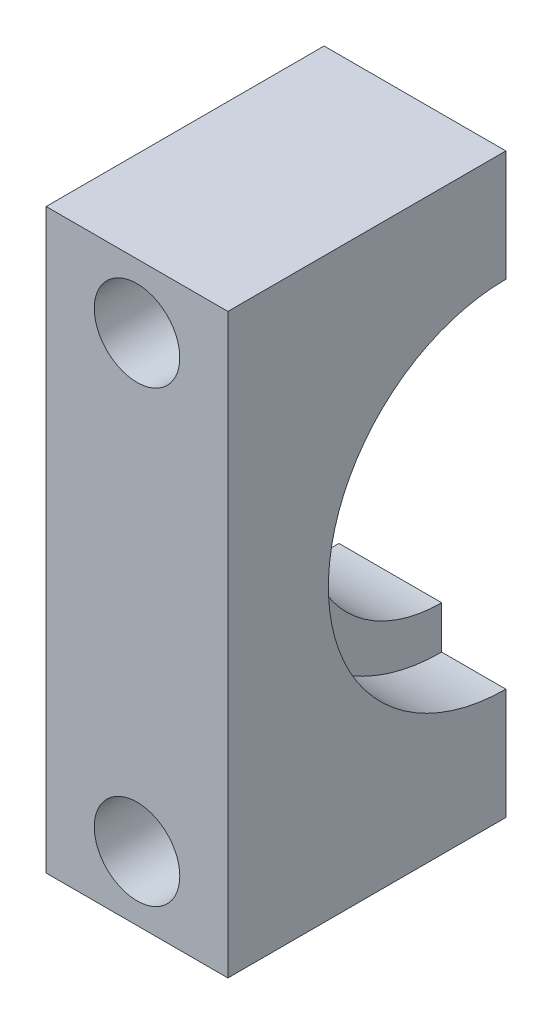
ISO-10303-21;
HEADER;
FILE_DESCRIPTION(('STEP AP214'),'2;1');
FILE_NAME('part.step','',(''),(''),'','','');
FILE_SCHEMA(('AUTOMOTIVE_DESIGN { 1 0 10303 214 1 1 1 1 }'));
ENDSEC;
DATA;
#1=APPLICATION_CONTEXT('core data for automotive mechanical design processes');
#2=APPLICATION_PROTOCOL_DEFINITION('international standard','automotive_design',2000,#1);
#3=PRODUCT_CONTEXT('',#1,'mechanical');
#4=PRODUCT('Part','Part','',(#3));
#5=PRODUCT_RELATED_PRODUCT_CATEGORY('part','',(#4));
#6=PRODUCT_DEFINITION_FORMATION('','',#4);
#7=PRODUCT_DEFINITION_CONTEXT('part definition',#1,'design');
#8=PRODUCT_DEFINITION('design','',#6,#7);
#9=PRODUCT_DEFINITION_SHAPE('','',#8);
#10=(LENGTH_UNIT() NAMED_UNIT(*) SI_UNIT(.MILLI.,.METRE.));
#11=(NAMED_UNIT(*) PLANE_ANGLE_UNIT() SI_UNIT($,.RADIAN.));
#12=(NAMED_UNIT(*) SI_UNIT($,.STERADIAN.) SOLID_ANGLE_UNIT());
#13=UNCERTAINTY_MEASURE_WITH_UNIT(LENGTH_MEASURE(1.E-05),#10,'distance_accuracy_value','');
#14=(GEOMETRIC_REPRESENTATION_CONTEXT(3) GLOBAL_UNCERTAINTY_ASSIGNED_CONTEXT((#13)) GLOBAL_UNIT_ASSIGNED_CONTEXT((#10,
#11,#12)) REPRESENTATION_CONTEXT('',''));
#15=CARTESIAN_POINT('',(0.,0.,0.));
#16=DIRECTION('',(0.,0.,1.));
#17=DIRECTION('',(1.,0.,0.));
#18=AXIS2_PLACEMENT_3D('',#15,#16,#17);
#19=CARTESIAN_POINT('',(0.,0.,0.));
#20=DIRECTION('',(0.,0.,1.));
#21=DIRECTION('',(1.,0.,0.));
#22=AXIS2_PLACEMENT_3D('',#19,#20,#21);
#23=PLANE('',#22);
#24=CARTESIAN_POINT('',(4.75,212.968429512973,0.));
#25=DIRECTION('',(0.,0.,1.));
#26=DIRECTION('',(-1.,0.,0.));
#27=AXIS2_PLACEMENT_3D('',#24,#25,#26);
#28=CIRCLE('',#27,2.);
#29=CARTESIAN_POINT('',(2.75,212.968429512973,0.));
#30=VERTEX_POINT('',#29);
#31=EDGE_CURVE('E194',#30,#30,#28,.T.);
#32=ORIENTED_EDGE('',*,*,#31,.T.);
#33=EDGE_LOOP('',(#32));
#34=FACE_BOUND('',#33,.T.);
#35=DIRECTION('',(0.,-1.,0.));
#36=VECTOR('',#35,1.);
#37=CARTESIAN_POINT('',(1.2,0.,0.));
#38=LINE('',#37,#36);
#39=CARTESIAN_POINT('',(1.2,210.768429512973,0.));
#40=VERTEX_POINT('',#39);
#41=CARTESIAN_POINT('',(1.2,208.768429512973,0.));
#42=VERTEX_POINT('',#41);
#43=EDGE_CURVE('E48',#40,#42,#38,.T.);
#44=ORIENTED_EDGE('',*,*,#43,.F.);
#45=DIRECTION('',(-1.,0.,0.));
#46=VECTOR('',#45,1.);
#47=CARTESIAN_POINT('',(1.2,210.768429512973,0.));
#48=LINE('',#47,#46);
#49=CARTESIAN_POINT('',(0.5,210.768429512973,0.));
#50=VERTEX_POINT('',#49);
#51=EDGE_CURVE('E11',#40,#50,#48,.T.);
#52=ORIENTED_EDGE('',*,*,#51,.T.);
#53=DIRECTION('',(0.,-1.,0.));
#54=VECTOR('',#53,1.);
#55=CARTESIAN_POINT('',(0.5,215.968429512973,0.));
#56=LINE('',#55,#54);
#57=CARTESIAN_POINT('',(0.5,215.968429512973,0.));
#58=VERTEX_POINT('',#57);
#59=EDGE_CURVE('E154',#58,#50,#56,.T.);
#60=ORIENTED_EDGE('',*,*,#59,.F.);
#61=DIRECTION('',(-1.,0.,0.));
#62=VECTOR('',#61,1.);
#63=CARTESIAN_POINT('',(9.,215.968429512973,0.));
#64=LINE('',#63,#62);
#65=CARTESIAN_POINT('',(9.,215.968429512973,0.));
#66=VERTEX_POINT('',#65);
#67=EDGE_CURVE('E151',#66,#58,#64,.T.);
#68=ORIENTED_EDGE('',*,*,#67,.F.);
#69=DIRECTION('',(0.,1.,0.));
#70=VECTOR('',#69,1.);
#71=CARTESIAN_POINT('',(9.,188.968429512973,0.));
#72=LINE('',#71,#70);
#73=CARTESIAN_POINT('',(9.,210.768429512973,0.));
#74=VERTEX_POINT('',#73);
#75=EDGE_CURVE('E135',#74,#66,#72,.T.);
#76=ORIENTED_EDGE('',*,*,#75,.F.);
#77=DIRECTION('',(1.,0.,0.));
#78=VECTOR('',#77,1.);
#79=CARTESIAN_POINT('',(6.,210.768429512973,0.));
#80=LINE('',#79,#78);
#81=CARTESIAN_POINT('',(6.,210.768429512973,0.));
#82=VERTEX_POINT('',#81);
#83=EDGE_CURVE('E172',#74,#82,#80,.F.);
#84=ORIENTED_EDGE('',*,*,#83,.T.);
#85=DIRECTION('',(0.,1.,0.));
#86=VECTOR('',#85,1.);
#87=CARTESIAN_POINT('',(6.,0.,0.));
#88=LINE('',#87,#86);
#89=CARTESIAN_POINT('',(6.,208.768429512973,0.));
#90=VERTEX_POINT('',#89);
#91=EDGE_CURVE('E168',#90,#82,#88,.T.);
#92=ORIENTED_EDGE('',*,*,#91,.F.);
#93=DIRECTION('',(1.,0.,0.));
#94=VECTOR('',#93,1.);
#95=CARTESIAN_POINT('',(1.,208.768429512973,0.));
#96=LINE('',#95,#94);
#97=EDGE_CURVE('E55',#90,#42,#96,.F.);
#98=ORIENTED_EDGE('',*,*,#97,.T.);
#99=EDGE_LOOP('',(#44,#52,#60,#68,#76,#84,#92,#98));
#100=FACE_BOUND('',#99,.T.);
#101=ADVANCED_FACE('F33',(#34,#100),#23,.F.);
#102=CARTESIAN_POINT('',(1.,202.468429512973,0.));
#103=DIRECTION('',(1.,0.,0.));
#104=DIRECTION('',(0.,0.,-1.));
#105=AXIS2_PLACEMENT_3D('',#102,#103,#104);
#106=CYLINDRICAL_SURFACE('',#105,6.30000000000001);
#107=CARTESIAN_POINT('',(1.2,202.468429512973,0.));
#108=DIRECTION('',(-1.,0.,0.));
#109=DIRECTION('',(0.,0.,1.));
#110=AXIS2_PLACEMENT_3D('',#107,#108,#109);
#111=CIRCLE('',#110,6.30000000000001);
#112=CARTESIAN_POINT('',(1.2,196.168429512973,0.));
#113=VERTEX_POINT('',#112);
#114=EDGE_CURVE('E178',#42,#113,#111,.F.);
#115=ORIENTED_EDGE('',*,*,#114,.F.);
#116=ORIENTED_EDGE('',*,*,#97,.F.);
#117=CARTESIAN_POINT('',(6.,202.468429512973,0.));
#118=DIRECTION('',(1.,0.,0.));
#119=DIRECTION('',(0.,0.,-1.));
#120=AXIS2_PLACEMENT_3D('',#117,#118,#119);
#121=CIRCLE('',#120,6.30000000000001);
#122=CARTESIAN_POINT('',(6.,196.168429512973,0.));
#123=VERTEX_POINT('',#122);
#124=EDGE_CURVE('E124',#90,#123,#121,.T.);
#125=ORIENTED_EDGE('',*,*,#124,.T.);
#126=DIRECTION('',(1.,0.,0.));
#127=VECTOR('',#126,1.);
#128=CARTESIAN_POINT('',(1.,196.168429512973,0.));
#129=LINE('',#128,#127);
#130=EDGE_CURVE('E130',#113,#123,#129,.T.);
#131=ORIENTED_EDGE('',*,*,#130,.F.);
#132=EDGE_LOOP('',(#115,#116,#125,#131));
#133=FACE_BOUND('',#132,.T.);
#134=ADVANCED_FACE('F232',(#133),#106,.F.);
#135=CARTESIAN_POINT('',(9.,188.968429512973,13.));
#136=DIRECTION('',(-1.,0.,0.));
#137=DIRECTION('',(0.,0.,1.));
#138=AXIS2_PLACEMENT_3D('',#135,#136,#137);
#139=PLANE('',#138);
#140=CARTESIAN_POINT('',(9.,188.968429512973,0.));
#141=VERTEX_POINT('',#140);
#142=CARTESIAN_POINT('',(9.,194.168429512973,0.));
#143=VERTEX_POINT('',#142);
#144=EDGE_CURVE('E148',#141,#143,#72,.T.);
#145=ORIENTED_EDGE('',*,*,#144,.T.);
#146=CARTESIAN_POINT('',(9.,202.468429512973,0.));
#147=DIRECTION('',(1.,0.,0.));
#148=DIRECTION('',(0.,0.,-1.));
#149=AXIS2_PLACEMENT_3D('',#146,#147,#148);
#150=CIRCLE('',#149,8.30000000000001);
#151=EDGE_CURVE('E132',#74,#143,#150,.T.);
#152=ORIENTED_EDGE('',*,*,#151,.F.);
#153=ORIENTED_EDGE('',*,*,#75,.T.);
#154=DIRECTION('',(0.,0.,-1.));
#155=VECTOR('',#154,1.);
#156=CARTESIAN_POINT('',(9.,215.968429512973,13.));
#157=LINE('',#156,#155);
#158=CARTESIAN_POINT('',(9.,215.968429512973,13.));
#159=VERTEX_POINT('',#158);
#160=EDGE_CURVE('E165',#159,#66,#157,.T.);
#161=ORIENTED_EDGE('',*,*,#160,.F.);
#162=DIRECTION('',(0.,1.,0.));
#163=VECTOR('',#162,1.);
#164=CARTESIAN_POINT('',(9.,188.968429512973,13.));
#165=LINE('',#164,#163);
#166=CARTESIAN_POINT('',(9.,188.968429512973,13.));
#167=VERTEX_POINT('',#166);
#168=EDGE_CURVE('E137',#167,#159,#165,.T.);
#169=ORIENTED_EDGE('',*,*,#168,.F.);
#170=DIRECTION('',(0.,0.,-1.));
#171=VECTOR('',#170,1.);
#172=CARTESIAN_POINT('',(9.,188.968429512973,13.));
#173=LINE('',#172,#171);
#174=EDGE_CURVE('E147',#167,#141,#173,.T.);
#175=ORIENTED_EDGE('',*,*,#174,.T.);
#176=EDGE_LOOP('',(#145,#152,#153,#161,#169,#175));
#177=FACE_BOUND('',#176,.T.);
#178=ADVANCED_FACE('F35',(#177),#139,.F.);
#179=CARTESIAN_POINT('',(9.,215.968429512973,13.));
#180=DIRECTION('',(0.,-1.,0.));
#181=DIRECTION('',(0.,0.,-1.));
#182=AXIS2_PLACEMENT_3D('',#179,#180,#181);
#183=PLANE('',#182);
#184=ORIENTED_EDGE('',*,*,#67,.T.);
#185=DIRECTION('',(0.,0.,-1.));
#186=VECTOR('',#185,1.);
#187=CARTESIAN_POINT('',(0.5,215.968429512973,13.));
#188=LINE('',#187,#186);
#189=CARTESIAN_POINT('',(0.5,215.968429512973,13.));
#190=VERTEX_POINT('',#189);
#191=EDGE_CURVE('E162',#190,#58,#188,.T.);
#192=ORIENTED_EDGE('',*,*,#191,.F.);
#193=DIRECTION('',(-1.,0.,0.));
#194=VECTOR('',#193,1.);
#195=CARTESIAN_POINT('',(9.,215.968429512973,13.));
#196=LINE('',#195,#194);
#197=EDGE_CURVE('E140',#159,#190,#196,.T.);
#198=ORIENTED_EDGE('',*,*,#197,.F.);
#199=ORIENTED_EDGE('',*,*,#160,.T.);
#200=EDGE_LOOP('',(#184,#192,#198,#199));
#201=FACE_BOUND('',#200,.T.);
#202=ADVANCED_FACE('F221',(#201),#183,.F.);
#203=CARTESIAN_POINT('',(0.5,215.968429512973,13.));
#204=DIRECTION('',(1.,0.,0.));
#205=DIRECTION('',(0.,0.,-1.));
#206=AXIS2_PLACEMENT_3D('',#203,#204,#205);
#207=PLANE('',#206);
#208=ORIENTED_EDGE('',*,*,#59,.T.);
#209=CARTESIAN_POINT('',(0.5,202.468429512973,0.));
#210=DIRECTION('',(-1.,0.,0.));
#211=DIRECTION('',(0.,0.,1.));
#212=AXIS2_PLACEMENT_3D('',#209,#210,#211);
#213=CIRCLE('',#212,8.30000000000001);
#214=CARTESIAN_POINT('',(0.5,194.168429512973,0.));
#215=VERTEX_POINT('',#214);
#216=EDGE_CURVE('E115',#215,#50,#213,.T.);
#217=ORIENTED_EDGE('',*,*,#216,.F.);
#218=CARTESIAN_POINT('',(0.5,188.968429512973,0.));
#219=VERTEX_POINT('',#218);
#220=EDGE_CURVE('E153',#215,#219,#56,.T.);
#221=ORIENTED_EDGE('',*,*,#220,.T.);
#222=DIRECTION('',(0.,0.,-1.));
#223=VECTOR('',#222,1.);
#224=CARTESIAN_POINT('',(0.5,188.968429512973,13.));
#225=LINE('',#224,#223);
#226=CARTESIAN_POINT('',(0.5,188.968429512973,13.));
#227=VERTEX_POINT('',#226);
#228=EDGE_CURVE('E159',#227,#219,#225,.T.);
#229=ORIENTED_EDGE('',*,*,#228,.F.);
#230=DIRECTION('',(0.,-1.,0.));
#231=VECTOR('',#230,1.);
#232=CARTESIAN_POINT('',(0.5,215.968429512973,13.));
#233=LINE('',#232,#231);
#234=EDGE_CURVE('E143',#190,#227,#233,.T.);
#235=ORIENTED_EDGE('',*,*,#234,.F.);
#236=ORIENTED_EDGE('',*,*,#191,.T.);
#237=EDGE_LOOP('',(#208,#217,#221,#229,#235,#236));
#238=FACE_BOUND('',#237,.T.);
#239=ADVANCED_FACE('F185',(#238),#207,.F.);
#240=CARTESIAN_POINT('',(9.,188.968429512973,13.));
#241=DIRECTION('',(0.,1.,0.));
#242=DIRECTION('',(0.,0.,1.));
#243=AXIS2_PLACEMENT_3D('',#240,#241,#242);
#244=PLANE('',#243);
#245=DIRECTION('',(1.,0.,0.));
#246=VECTOR('',#245,1.);
#247=CARTESIAN_POINT('',(9.,188.968429512973,0.));
#248=LINE('',#247,#246);
#249=EDGE_CURVE('E141',#219,#141,#248,.T.);
#250=ORIENTED_EDGE('',*,*,#249,.T.);
#251=ORIENTED_EDGE('',*,*,#174,.F.);
#252=DIRECTION('',(1.,0.,0.));
#253=VECTOR('',#252,1.);
#254=CARTESIAN_POINT('',(9.,188.968429512973,13.));
#255=LINE('',#254,#253);
#256=EDGE_CURVE('E145',#227,#167,#255,.T.);
#257=ORIENTED_EDGE('',*,*,#256,.F.);
#258=ORIENTED_EDGE('',*,*,#228,.T.);
#259=EDGE_LOOP('',(#250,#251,#257,#258));
#260=FACE_BOUND('',#259,.T.);
#261=ADVANCED_FACE('F208',(#260),#244,.F.);
#262=CARTESIAN_POINT('',(0.,0.,13.));
#263=DIRECTION('',(0.,0.,1.));
#264=DIRECTION('',(1.,0.,0.));
#265=AXIS2_PLACEMENT_3D('',#262,#263,#264);
#266=PLANE('',#265);
#267=CARTESIAN_POINT('',(4.75,191.968429512973,13.));
#268=DIRECTION('',(0.,0.,1.));
#269=DIRECTION('',(1.,0.,0.));
#270=AXIS2_PLACEMENT_3D('',#267,#268,#269);
#271=CIRCLE('',#270,2.);
#272=CARTESIAN_POINT('',(6.75,191.968429512973,13.));
#273=VERTEX_POINT('',#272);
#274=EDGE_CURVE('E189',#273,#273,#271,.T.);
#275=ORIENTED_EDGE('',*,*,#274,.F.);
#276=EDGE_LOOP('',(#275));
#277=FACE_BOUND('',#276,.T.);
#278=CARTESIAN_POINT('',(4.75,212.968429512973,13.));
#279=DIRECTION('',(0.,0.,1.));
#280=DIRECTION('',(-1.,0.,0.));
#281=AXIS2_PLACEMENT_3D('',#278,#279,#280);
#282=CIRCLE('',#281,2.);
#283=CARTESIAN_POINT('',(2.75,212.968429512973,13.));
#284=VERTEX_POINT('',#283);
#285=EDGE_CURVE('E199',#284,#284,#282,.T.);
#286=ORIENTED_EDGE('',*,*,#285,.F.);
#287=EDGE_LOOP('',(#286));
#288=FACE_BOUND('',#287,.T.);
#289=ORIENTED_EDGE('',*,*,#168,.T.);
#290=ORIENTED_EDGE('',*,*,#197,.T.);
#291=ORIENTED_EDGE('',*,*,#234,.T.);
#292=ORIENTED_EDGE('',*,*,#256,.T.);
#293=EDGE_LOOP('',(#289,#290,#291,#292));
#294=FACE_BOUND('',#293,.T.);
#295=ADVANCED_FACE('F205',(#277,#288,#294),#266,.T.);
#296=CARTESIAN_POINT('',(4.75,191.968429512973,0.));
#297=DIRECTION('',(0.,0.,1.));
#298=DIRECTION('',(1.,0.,0.));
#299=AXIS2_PLACEMENT_3D('',#296,#297,#298);
#300=CIRCLE('',#299,2.);
#301=CARTESIAN_POINT('',(6.75,191.968429512973,0.));
#302=VERTEX_POINT('',#301);
#303=EDGE_CURVE('E187',#302,#302,#300,.T.);
#304=ORIENTED_EDGE('',*,*,#303,.T.);
#305=EDGE_LOOP('',(#304));
#306=FACE_BOUND('',#305,.T.);
#307=ORIENTED_EDGE('',*,*,#220,.F.);
#308=DIRECTION('',(-1.,0.,0.));
#309=VECTOR('',#308,1.);
#310=CARTESIAN_POINT('',(1.2,194.168429512973,0.));
#311=LINE('',#310,#309);
#312=CARTESIAN_POINT('',(1.2,194.168429512973,0.));
#313=VERTEX_POINT('',#312);
#314=EDGE_CURVE('E41',#215,#313,#311,.F.);
#315=ORIENTED_EDGE('',*,*,#314,.T.);
#316=EDGE_CURVE('E121',#113,#313,#38,.T.);
#317=ORIENTED_EDGE('',*,*,#316,.F.);
#318=ORIENTED_EDGE('',*,*,#130,.T.);
#319=CARTESIAN_POINT('',(6.,194.168429512973,0.));
#320=VERTEX_POINT('',#319);
#321=EDGE_CURVE('E169',#320,#123,#88,.T.);
#322=ORIENTED_EDGE('',*,*,#321,.F.);
#323=DIRECTION('',(1.,0.,0.));
#324=VECTOR('',#323,1.);
#325=CARTESIAN_POINT('',(6.,194.168429512973,0.));
#326=LINE('',#325,#324);
#327=EDGE_CURVE('E175',#320,#143,#326,.T.);
#328=ORIENTED_EDGE('',*,*,#327,.T.);
#329=ORIENTED_EDGE('',*,*,#144,.F.);
#330=ORIENTED_EDGE('',*,*,#249,.F.);
#331=EDGE_LOOP('',(#307,#315,#317,#318,#322,#328,#329,#330));
#332=FACE_BOUND('',#331,.T.);
#333=ADVANCED_FACE('F181',(#306,#332),#23,.F.);
#334=CARTESIAN_POINT('',(6.,202.468429512973,0.));
#335=DIRECTION('',(1.,0.,0.));
#336=DIRECTION('',(0.,0.,-1.));
#337=AXIS2_PLACEMENT_3D('',#334,#335,#336);
#338=CYLINDRICAL_SURFACE('',#337,8.30000000000001);
#339=CARTESIAN_POINT('',(6.,202.468429512973,0.));
#340=DIRECTION('',(1.,0.,0.));
#341=DIRECTION('',(0.,0.,-1.));
#342=AXIS2_PLACEMENT_3D('',#339,#340,#341);
#343=CIRCLE('',#342,8.30000000000001);
#344=EDGE_CURVE('E133',#82,#320,#343,.T.);
#345=ORIENTED_EDGE('',*,*,#344,.F.);
#346=ORIENTED_EDGE('',*,*,#83,.F.);
#347=ORIENTED_EDGE('',*,*,#151,.T.);
#348=ORIENTED_EDGE('',*,*,#327,.F.);
#349=EDGE_LOOP('',(#345,#346,#347,#348));
#350=FACE_BOUND('',#349,.T.);
#351=ADVANCED_FACE('F229',(#350),#338,.F.);
#352=CARTESIAN_POINT('',(6.,202.468429512973,0.));
#353=DIRECTION('',(1.,0.,0.));
#354=DIRECTION('',(0.,0.,-1.));
#355=AXIS2_PLACEMENT_3D('',#352,#353,#354);
#356=PLANE('',#355);
#357=ORIENTED_EDGE('',*,*,#124,.F.);
#358=ORIENTED_EDGE('',*,*,#91,.T.);
#359=ORIENTED_EDGE('',*,*,#344,.T.);
#360=ORIENTED_EDGE('',*,*,#321,.T.);
#361=EDGE_LOOP('',(#357,#358,#359,#360));
#362=FACE_BOUND('',#361,.T.);
#363=ADVANCED_FACE('F231',(#362),#356,.T.);
#364=CARTESIAN_POINT('',(1.2,202.468429512973,0.));
#365=DIRECTION('',(-1.,0.,0.));
#366=DIRECTION('',(0.,0.,1.));
#367=AXIS2_PLACEMENT_3D('',#364,#365,#366);
#368=CYLINDRICAL_SURFACE('',#367,8.30000000000001);
#369=CARTESIAN_POINT('',(1.2,202.468429512973,0.));
#370=DIRECTION('',(-1.,0.,0.));
#371=DIRECTION('',(0.,0.,1.));
#372=AXIS2_PLACEMENT_3D('',#369,#370,#371);
#373=CIRCLE('',#372,8.30000000000001);
#374=EDGE_CURVE('E112',#313,#40,#373,.T.);
#375=ORIENTED_EDGE('',*,*,#374,.F.);
#376=ORIENTED_EDGE('',*,*,#314,.F.);
#377=ORIENTED_EDGE('',*,*,#216,.T.);
#378=ORIENTED_EDGE('',*,*,#51,.F.);
#379=EDGE_LOOP('',(#375,#376,#377,#378));
#380=FACE_BOUND('',#379,.T.);
#381=ADVANCED_FACE('F111',(#380),#368,.F.);
#382=CARTESIAN_POINT('',(1.2,202.468429512973,0.));
#383=DIRECTION('',(-1.,0.,0.));
#384=DIRECTION('',(0.,0.,1.));
#385=AXIS2_PLACEMENT_3D('',#382,#383,#384);
#386=PLANE('',#385);
#387=ORIENTED_EDGE('',*,*,#43,.T.);
#388=ORIENTED_EDGE('',*,*,#114,.T.);
#389=ORIENTED_EDGE('',*,*,#316,.T.);
#390=ORIENTED_EDGE('',*,*,#374,.T.);
#391=EDGE_LOOP('',(#387,#388,#389,#390));
#392=FACE_BOUND('',#391,.T.);
#393=ADVANCED_FACE('F119',(#392),#386,.T.);
#394=CARTESIAN_POINT('',(4.75,191.968429512973,0.));
#395=DIRECTION('',(0.,0.,1.));
#396=DIRECTION('',(1.,0.,0.));
#397=AXIS2_PLACEMENT_3D('',#394,#395,#396);
#398=CYLINDRICAL_SURFACE('',#397,2.);
#399=ORIENTED_EDGE('',*,*,#303,.F.);
#400=EDGE_LOOP('',(#399));
#401=FACE_BOUND('',#400,.T.);
#402=ORIENTED_EDGE('',*,*,#274,.T.);
#403=EDGE_LOOP('',(#402));
#404=FACE_BOUND('',#403,.T.);
#405=ADVANCED_FACE('F294',(#401,#404),#398,.F.);
#406=CARTESIAN_POINT('',(4.75,212.968429512973,0.));
#407=DIRECTION('',(0.,0.,1.));
#408=DIRECTION('',(1.,0.,0.));
#409=AXIS2_PLACEMENT_3D('',#406,#407,#408);
#410=CYLINDRICAL_SURFACE('',#409,2.);
#411=ORIENTED_EDGE('',*,*,#31,.F.);
#412=EDGE_LOOP('',(#411));
#413=FACE_BOUND('',#412,.T.);
#414=ORIENTED_EDGE('',*,*,#285,.T.);
#415=EDGE_LOOP('',(#414));
#416=FACE_BOUND('',#415,.T.);
#417=ADVANCED_FACE('F203',(#413,#416),#410,.F.);
#418=CLOSED_SHELL('',(#101,#134,#178,#202,#239,#261,#295,#333,#351,#363,#381,#393,#405,#417));
#419=MANIFOLD_SOLID_BREP('B2',#418);
#420=ADVANCED_BREP_SHAPE_REPRESENTATION('',(#18,#419),#14);
#421=SHAPE_DEFINITION_REPRESENTATION(#9,#420);
ENDSEC;
END-ISO-10303-21;
